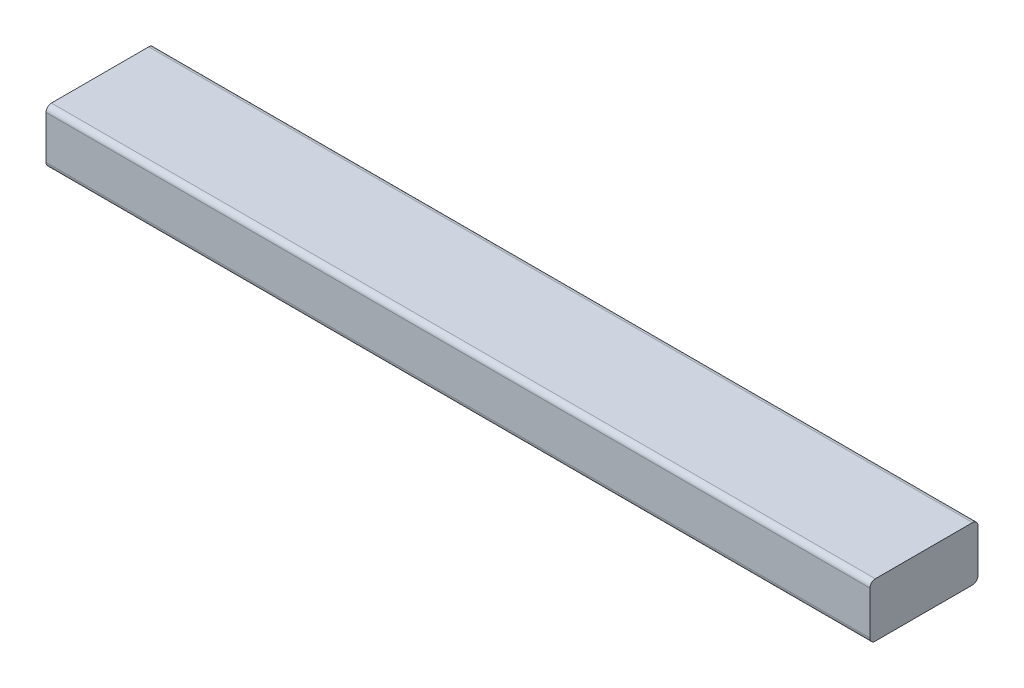
ISO-10303-21;
HEADER;
FILE_DESCRIPTION(('STEP AP214'),'2;1');
FILE_NAME('part.step','',(''),(''),'','','');
FILE_SCHEMA(('AUTOMOTIVE_DESIGN { 1 0 10303 214 1 1 1 1 }'));
ENDSEC;
DATA;
#1=APPLICATION_CONTEXT('core data for automotive mechanical design processes');
#2=APPLICATION_PROTOCOL_DEFINITION('international standard','automotive_design',2000,#1);
#3=PRODUCT_CONTEXT('',#1,'mechanical');
#4=PRODUCT('Part','Part','',(#3));
#5=PRODUCT_RELATED_PRODUCT_CATEGORY('part','',(#4));
#6=PRODUCT_DEFINITION_FORMATION('','',#4);
#7=PRODUCT_DEFINITION_CONTEXT('part definition',#1,'design');
#8=PRODUCT_DEFINITION('design','',#6,#7);
#9=PRODUCT_DEFINITION_SHAPE('','',#8);
#10=(LENGTH_UNIT() NAMED_UNIT(*) SI_UNIT(.MILLI.,.METRE.));
#11=(NAMED_UNIT(*) PLANE_ANGLE_UNIT() SI_UNIT($,.RADIAN.));
#12=(NAMED_UNIT(*) SI_UNIT($,.STERADIAN.) SOLID_ANGLE_UNIT());
#13=UNCERTAINTY_MEASURE_WITH_UNIT(LENGTH_MEASURE(1.E-05),#10,'distance_accuracy_value','');
#14=(GEOMETRIC_REPRESENTATION_CONTEXT(3) GLOBAL_UNCERTAINTY_ASSIGNED_CONTEXT((#13)) GLOBAL_UNIT_ASSIGNED_CONTEXT((#10,
#11,#12)) REPRESENTATION_CONTEXT('',''));
#15=CARTESIAN_POINT('',(0.,0.,0.));
#16=DIRECTION('',(0.,0.,1.));
#17=DIRECTION('',(1.,0.,0.));
#18=AXIS2_PLACEMENT_3D('',#15,#16,#17);
#19=CARTESIAN_POINT('',(2587.29999999996,38.100000000002,-160.699999999997));
#20=DIRECTION('',(1.,0.,0.));
#21=DIRECTION('',(0.,1.,0.));
#22=AXIS2_PLACEMENT_3D('',#19,#20,#21);
#23=PLANE('',#22);
#24=DIRECTION('',(0.,0.,1.));
#25=VECTOR('',#24,1.);
#26=CARTESIAN_POINT('',(2587.29999999996,-12.699999999998,-160.699999999996));
#27=LINE('',#26,#25);
#28=CARTESIAN_POINT('',(2587.29999999996,-12.6999999999997,-257.219999999996));
#29=VERTEX_POINT('',#28);
#30=CARTESIAN_POINT('',(2587.29999999996,-12.6999999999981,-165.779999999996));
#31=VERTEX_POINT('',#30);
#32=EDGE_CURVE('E137',#29,#31,#27,.T.);
#33=ORIENTED_EDGE('',*,*,#32,.F.);
#34=CARTESIAN_POINT('',(2587.29999999996,-7.61999999999972,-257.219999999996));
#35=DIRECTION('',(1.,0.,0.));
#36=DIRECTION('',(0.,1.,0.));
#37=AXIS2_PLACEMENT_3D('',#34,#35,#36);
#38=CIRCLE('',#37,5.08);
#39=CARTESIAN_POINT('',(2587.29999999996,-7.61999999999981,-262.299999999996));
#40=VERTEX_POINT('',#39);
#41=EDGE_CURVE('E118',#29,#40,#38,.T.);
#42=ORIENTED_EDGE('',*,*,#41,.T.);
#43=DIRECTION('',(0.,-1.,0.));
#44=VECTOR('',#43,1.);
#45=CARTESIAN_POINT('',(2587.29999999996,38.1000000000002,-262.299999999997));
#46=LINE('',#45,#44);
#47=CARTESIAN_POINT('',(2587.29999999996,33.0200000000002,-262.299999999996));
#48=VERTEX_POINT('',#47);
#49=EDGE_CURVE('E156',#48,#40,#46,.T.);
#50=ORIENTED_EDGE('',*,*,#49,.F.);
#51=CARTESIAN_POINT('',(2587.29999999996,33.0200000000003,-257.219999999996));
#52=DIRECTION('',(1.,0.,0.));
#53=DIRECTION('',(0.,1.,0.));
#54=AXIS2_PLACEMENT_3D('',#51,#52,#53);
#55=CIRCLE('',#54,5.08);
#56=CARTESIAN_POINT('',(2587.29999999996,38.1000000000003,-257.219999999997));
#57=VERTEX_POINT('',#56);
#58=EDGE_CURVE('E142',#48,#57,#55,.T.);
#59=ORIENTED_EDGE('',*,*,#58,.T.);
#60=DIRECTION('',(0.,0.,1.));
#61=VECTOR('',#60,1.);
#62=CARTESIAN_POINT('',(2587.29999999996,38.100000000002,-160.699999999997));
#63=LINE('',#62,#61);
#64=CARTESIAN_POINT('',(2587.29999999996,38.1000000000019,-165.779999999997));
#65=VERTEX_POINT('',#64);
#66=EDGE_CURVE('E150',#57,#65,#63,.T.);
#67=ORIENTED_EDGE('',*,*,#66,.T.);
#68=CARTESIAN_POINT('',(2587.29999999996,33.0200000000019,-165.779999999996));
#69=DIRECTION('',(1.,0.,0.));
#70=DIRECTION('',(0.,1.,0.));
#71=AXIS2_PLACEMENT_3D('',#68,#69,#70);
#72=CIRCLE('',#71,5.08);
#73=CARTESIAN_POINT('',(2587.29999999996,33.020000000002,-160.699999999996));
#74=VERTEX_POINT('',#73);
#75=EDGE_CURVE('E174',#65,#74,#72,.T.);
#76=ORIENTED_EDGE('',*,*,#75,.T.);
#77=DIRECTION('',(0.,-1.,0.));
#78=VECTOR('',#77,1.);
#79=CARTESIAN_POINT('',(2587.29999999996,38.100000000002,-160.699999999997));
#80=LINE('',#79,#78);
#81=CARTESIAN_POINT('',(2587.29999999996,-7.61999999999798,-160.699999999996));
#82=VERTEX_POINT('',#81);
#83=EDGE_CURVE('E167',#74,#82,#80,.T.);
#84=ORIENTED_EDGE('',*,*,#83,.T.);
#85=CARTESIAN_POINT('',(2587.29999999996,-7.61999999999806,-165.779999999996));
#86=DIRECTION('',(1.,0.,0.));
#87=DIRECTION('',(0.,1.,0.));
#88=AXIS2_PLACEMENT_3D('',#85,#86,#87);
#89=CIRCLE('',#88,5.08);
#90=EDGE_CURVE('E130',#82,#31,#89,.T.);
#91=ORIENTED_EDGE('',*,*,#90,.T.);
#92=EDGE_LOOP('',(#33,#42,#50,#59,#67,#76,#84,#91));
#93=FACE_BOUND('',#92,.T.);
#94=ADVANCED_FACE('F45',(#93),#23,.T.);
#95=CARTESIAN_POINT('',(2587.29999999996,38.1000000000002,-262.299999999997));
#96=DIRECTION('',(0.,0.,-1.));
#97=DIRECTION('',(0.,1.,0.));
#98=AXIS2_PLACEMENT_3D('',#95,#96,#97);
#99=PLANE('',#98);
#100=ORIENTED_EDGE('',*,*,#49,.T.);
#101=DIRECTION('',(1.,0.,0.));
#102=VECTOR('',#101,1.);
#103=CARTESIAN_POINT('',(1812.69999999996,-7.62000000000386,-262.299999999996));
#104=LINE('',#103,#102);
#105=CARTESIAN_POINT('',(1812.69999999996,-7.62000000000386,-262.299999999996));
#106=VERTEX_POINT('',#105);
#107=EDGE_CURVE('E123',#40,#106,#104,.F.);
#108=ORIENTED_EDGE('',*,*,#107,.T.);
#109=DIRECTION('',(0.,-1.,0.));
#110=VECTOR('',#109,1.);
#111=CARTESIAN_POINT('',(1812.69999999996,38.0999999999961,-262.299999999997));
#112=LINE('',#111,#110);
#113=CARTESIAN_POINT('',(1812.69999999996,33.0199999999961,-262.299999999996));
#114=VERTEX_POINT('',#113);
#115=EDGE_CURVE('E159',#114,#106,#112,.T.);
#116=ORIENTED_EDGE('',*,*,#115,.F.);
#117=DIRECTION('',(1.,0.,0.));
#118=VECTOR('',#117,1.);
#119=CARTESIAN_POINT('',(2587.29999999996,33.0200000000002,-262.299999999996));
#120=LINE('',#119,#118);
#121=EDGE_CURVE('E129',#114,#48,#120,.T.);
#122=ORIENTED_EDGE('',*,*,#121,.T.);
#123=EDGE_LOOP('',(#100,#108,#116,#122));
#124=FACE_BOUND('',#123,.T.);
#125=ADVANCED_FACE('F225',(#124),#99,.T.);
#126=CARTESIAN_POINT('',(1812.69999999996,38.099999999998,-160.699999999997));
#127=DIRECTION('',(-1.,0.,0.));
#128=DIRECTION('',(0.,-1.,0.));
#129=AXIS2_PLACEMENT_3D('',#126,#127,#128);
#130=PLANE('',#129);
#131=ORIENTED_EDGE('',*,*,#115,.T.);
#132=CARTESIAN_POINT('',(1812.69999999996,-7.62000000000377,-257.219999999996));
#133=DIRECTION('',(-1.,0.,0.));
#134=DIRECTION('',(0.,-1.,0.));
#135=AXIS2_PLACEMENT_3D('',#132,#133,#134);
#136=CIRCLE('',#135,5.08);
#137=CARTESIAN_POINT('',(1812.69999999996,-12.7000000000038,-257.219999999996));
#138=VERTEX_POINT('',#137);
#139=EDGE_CURVE('E192',#106,#138,#136,.T.);
#140=ORIENTED_EDGE('',*,*,#139,.T.);
#141=DIRECTION('',(0.,0.,-1.));
#142=VECTOR('',#141,1.);
#143=CARTESIAN_POINT('',(1812.69999999996,-12.700000000002,-160.699999999996));
#144=LINE('',#143,#142);
#145=CARTESIAN_POINT('',(1812.69999999996,-12.7000000000021,-165.779999999996));
#146=VERTEX_POINT('',#145);
#147=EDGE_CURVE('E140',#146,#138,#144,.T.);
#148=ORIENTED_EDGE('',*,*,#147,.F.);
#149=CARTESIAN_POINT('',(1812.69999999996,-7.62000000000211,-165.779999999996));
#150=DIRECTION('',(-1.,0.,0.));
#151=DIRECTION('',(0.,-1.,0.));
#152=AXIS2_PLACEMENT_3D('',#149,#150,#151);
#153=CIRCLE('',#152,5.08);
#154=CARTESIAN_POINT('',(1812.69999999996,-7.62000000000202,-160.699999999996));
#155=VERTEX_POINT('',#154);
#156=EDGE_CURVE('E189',#146,#155,#153,.T.);
#157=ORIENTED_EDGE('',*,*,#156,.T.);
#158=DIRECTION('',(0.,-1.,0.));
#159=VECTOR('',#158,1.);
#160=CARTESIAN_POINT('',(1812.69999999996,38.099999999998,-160.699999999997));
#161=LINE('',#160,#159);
#162=CARTESIAN_POINT('',(1812.69999999996,33.019999999998,-160.699999999996));
#163=VERTEX_POINT('',#162);
#164=EDGE_CURVE('E163',#163,#155,#161,.T.);
#165=ORIENTED_EDGE('',*,*,#164,.F.);
#166=CARTESIAN_POINT('',(1812.69999999996,33.0199999999979,-165.779999999996));
#167=DIRECTION('',(-1.,0.,0.));
#168=DIRECTION('',(0.,-1.,0.));
#169=AXIS2_PLACEMENT_3D('',#166,#167,#168);
#170=CIRCLE('',#169,5.08);
#171=CARTESIAN_POINT('',(1812.69999999996,38.0999999999979,-165.779999999997));
#172=VERTEX_POINT('',#171);
#173=EDGE_CURVE('E72',#163,#172,#170,.T.);
#174=ORIENTED_EDGE('',*,*,#173,.T.);
#175=DIRECTION('',(0.,0.,-1.));
#176=VECTOR('',#175,1.);
#177=CARTESIAN_POINT('',(1812.69999999996,38.099999999998,-160.699999999997));
#178=LINE('',#177,#176);
#179=CARTESIAN_POINT('',(1812.69999999996,38.0999999999962,-257.219999999997));
#180=VERTEX_POINT('',#179);
#181=EDGE_CURVE('E153',#172,#180,#178,.T.);
#182=ORIENTED_EDGE('',*,*,#181,.T.);
#183=CARTESIAN_POINT('',(1812.69999999996,33.0199999999962,-257.219999999996));
#184=DIRECTION('',(-1.,0.,0.));
#185=DIRECTION('',(0.,-1.,0.));
#186=AXIS2_PLACEMENT_3D('',#183,#184,#185);
#187=CIRCLE('',#186,5.08);
#188=EDGE_CURVE('E184',#180,#114,#187,.T.);
#189=ORIENTED_EDGE('',*,*,#188,.T.);
#190=EDGE_LOOP('',(#131,#140,#148,#157,#165,#174,#182,#189));
#191=FACE_BOUND('',#190,.T.);
#192=ADVANCED_FACE('F214',(#191),#130,.T.);
#193=CARTESIAN_POINT('',(2587.29999999996,38.100000000002,-160.699999999997));
#194=DIRECTION('',(0.,0.,1.));
#195=DIRECTION('',(0.,-1.,0.));
#196=AXIS2_PLACEMENT_3D('',#193,#194,#195);
#197=PLANE('',#196);
#198=ORIENTED_EDGE('',*,*,#164,.T.);
#199=DIRECTION('',(-1.,0.,0.));
#200=VECTOR('',#199,1.);
#201=CARTESIAN_POINT('',(2587.29999999996,-7.61999999999797,-160.699999999996));
#202=LINE('',#201,#200);
#203=EDGE_CURVE('E199',#155,#82,#202,.F.);
#204=ORIENTED_EDGE('',*,*,#203,.T.);
#205=ORIENTED_EDGE('',*,*,#83,.F.);
#206=DIRECTION('',(-1.,0.,0.));
#207=VECTOR('',#206,1.);
#208=CARTESIAN_POINT('',(2587.29999999996,33.020000000002,-160.699999999996));
#209=LINE('',#208,#207);
#210=EDGE_CURVE('E195',#74,#163,#209,.T.);
#211=ORIENTED_EDGE('',*,*,#210,.T.);
#212=EDGE_LOOP('',(#198,#204,#205,#211));
#213=FACE_BOUND('',#212,.T.);
#214=ADVANCED_FACE('F212',(#213),#197,.T.);
#215=CARTESIAN_POINT('',(-1.99228202541171E-13,38.0999999999914,-6.88847661806863E-13));
#216=DIRECTION('',(0.,1.,0.));
#217=DIRECTION('',(0.,0.,1.));
#218=AXIS2_PLACEMENT_3D('',#215,#216,#217);
#219=PLANE('',#218);
#220=ORIENTED_EDGE('',*,*,#181,.F.);
#221=DIRECTION('',(-1.,0.,0.));
#222=VECTOR('',#221,1.);
#223=CARTESIAN_POINT('',(-1.99228202541156E-13,38.0999999999884,-165.779999999997));
#224=LINE('',#223,#222);
#225=EDGE_CURVE('E11',#172,#65,#224,.F.);
#226=ORIENTED_EDGE('',*,*,#225,.T.);
#227=ORIENTED_EDGE('',*,*,#66,.F.);
#228=DIRECTION('',(1.,0.,0.));
#229=VECTOR('',#228,1.);
#230=CARTESIAN_POINT('',(-1.99228202541147E-13,38.0999999999868,-257.219999999997));
#231=LINE('',#230,#229);
#232=EDGE_CURVE('E54',#57,#180,#231,.F.);
#233=ORIENTED_EDGE('',*,*,#232,.T.);
#234=EDGE_LOOP('',(#220,#226,#227,#233));
#235=FACE_BOUND('',#234,.T.);
#236=ADVANCED_FACE('F235',(#235),#219,.T.);
#237=CARTESIAN_POINT('',(0.,-12.7000000000086,2.29634020132585E-13));
#238=DIRECTION('',(0.,1.,0.));
#239=DIRECTION('',(0.,0.,1.));
#240=AXIS2_PLACEMENT_3D('',#237,#238,#239);
#241=PLANE('',#240);
#242=ORIENTED_EDGE('',*,*,#147,.T.);
#243=DIRECTION('',(1.,0.,0.));
#244=VECTOR('',#243,1.);
#245=CARTESIAN_POINT('',(2587.29999999996,-12.6999999999997,-257.219999999996));
#246=LINE('',#245,#244);
#247=EDGE_CURVE('E122',#138,#29,#246,.T.);
#248=ORIENTED_EDGE('',*,*,#247,.T.);
#249=ORIENTED_EDGE('',*,*,#32,.T.);
#250=DIRECTION('',(-1.,0.,0.));
#251=VECTOR('',#250,1.);
#252=CARTESIAN_POINT('',(1812.69999999996,-12.7000000000021,-165.779999999996));
#253=LINE('',#252,#251);
#254=EDGE_CURVE('E143',#31,#146,#253,.T.);
#255=ORIENTED_EDGE('',*,*,#254,.T.);
#256=EDGE_LOOP('',(#242,#248,#249,#255));
#257=FACE_BOUND('',#256,.T.);
#258=ADVANCED_FACE('F135',(#257),#241,.F.);
#259=CARTESIAN_POINT('',(0.,-7.62000000001324,-257.219999999996));
#260=DIRECTION('',(-1.,0.,0.));
#261=DIRECTION('',(0.,-1.,0.));
#262=AXIS2_PLACEMENT_3D('',#259,#260,#261);
#263=CYLINDRICAL_SURFACE('',#262,5.08);
#264=ORIENTED_EDGE('',*,*,#139,.F.);
#265=ORIENTED_EDGE('',*,*,#107,.F.);
#266=ORIENTED_EDGE('',*,*,#41,.F.);
#267=ORIENTED_EDGE('',*,*,#247,.F.);
#268=EDGE_LOOP('',(#264,#265,#266,#267));
#269=FACE_BOUND('',#268,.T.);
#270=ADVANCED_FACE('F121',(#269),#263,.T.);
#271=CARTESIAN_POINT('',(0.,-7.62000000001159,-165.779999999996));
#272=DIRECTION('',(1.,0.,0.));
#273=DIRECTION('',(0.,1.,0.));
#274=AXIS2_PLACEMENT_3D('',#271,#272,#273);
#275=CYLINDRICAL_SURFACE('',#274,5.08);
#276=ORIENTED_EDGE('',*,*,#90,.F.);
#277=ORIENTED_EDGE('',*,*,#203,.F.);
#278=ORIENTED_EDGE('',*,*,#156,.F.);
#279=ORIENTED_EDGE('',*,*,#254,.F.);
#280=EDGE_LOOP('',(#276,#277,#278,#279));
#281=FACE_BOUND('',#280,.T.);
#282=ADVANCED_FACE('F216',(#281),#275,.T.);
#283=CARTESIAN_POINT('',(2587.29999999996,33.0200000000019,-165.779999999996));
#284=DIRECTION('',(-1.,0.,0.));
#285=DIRECTION('',(0.,-1.,0.));
#286=AXIS2_PLACEMENT_3D('',#283,#284,#285);
#287=CYLINDRICAL_SURFACE('',#286,5.08);
#288=ORIENTED_EDGE('',*,*,#75,.F.);
#289=ORIENTED_EDGE('',*,*,#225,.F.);
#290=ORIENTED_EDGE('',*,*,#173,.F.);
#291=ORIENTED_EDGE('',*,*,#210,.F.);
#292=EDGE_LOOP('',(#288,#289,#290,#291));
#293=FACE_BOUND('',#292,.T.);
#294=ADVANCED_FACE('F210',(#293),#287,.T.);
#295=CARTESIAN_POINT('',(2587.29999999996,33.0200000000003,-257.219999999996));
#296=DIRECTION('',(1.,0.,0.));
#297=DIRECTION('',(0.,1.,0.));
#298=AXIS2_PLACEMENT_3D('',#295,#296,#297);
#299=CYLINDRICAL_SURFACE('',#298,5.08);
#300=ORIENTED_EDGE('',*,*,#188,.F.);
#301=ORIENTED_EDGE('',*,*,#232,.F.);
#302=ORIENTED_EDGE('',*,*,#58,.F.);
#303=ORIENTED_EDGE('',*,*,#121,.F.);
#304=EDGE_LOOP('',(#300,#301,#302,#303));
#305=FACE_BOUND('',#304,.T.);
#306=ADVANCED_FACE('F47',(#305),#299,.T.);
#307=CLOSED_SHELL('',(#94,#125,#192,#214,#236,#258,#270,#282,#294,#306));
#308=MANIFOLD_SOLID_BREP('B2',#307);
#309=ADVANCED_BREP_SHAPE_REPRESENTATION('',(#18,#308),#14);
#310=SHAPE_DEFINITION_REPRESENTATION(#9,#309);
ENDSEC;
END-ISO-10303-21;
